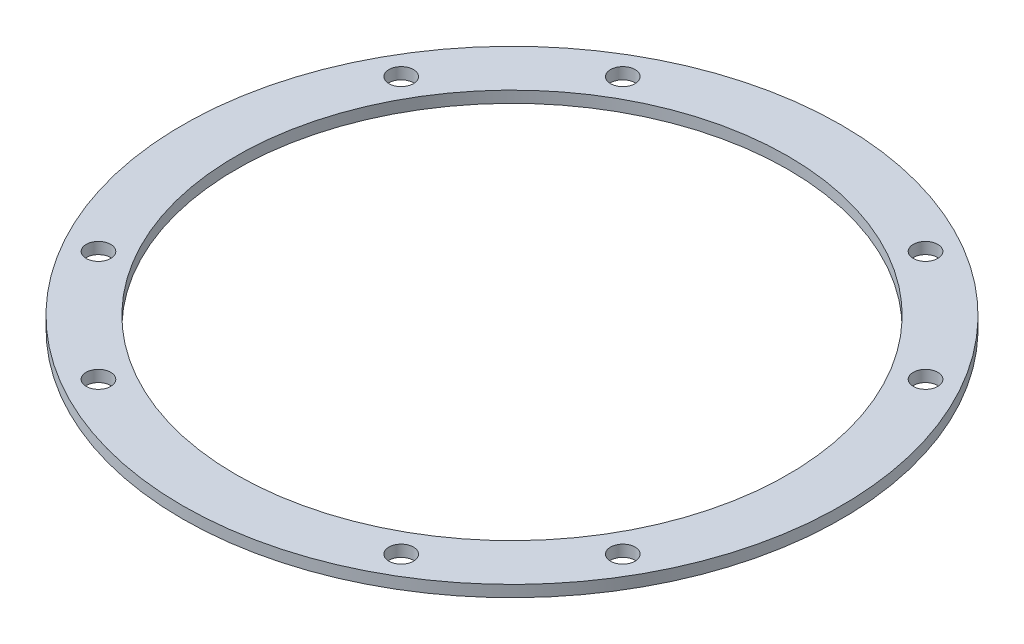
ISO-10303-21;
HEADER;
FILE_DESCRIPTION(('STEP AP214'),'2;1');
FILE_NAME('part.step','',(''),(''),'','','');
FILE_SCHEMA(('AUTOMOTIVE_DESIGN { 1 0 10303 214 1 1 1 1 }'));
ENDSEC;
DATA;
#1=APPLICATION_CONTEXT('core data for automotive mechanical design processes');
#2=APPLICATION_PROTOCOL_DEFINITION('international standard','automotive_design',2000,#1);
#3=PRODUCT_CONTEXT('',#1,'mechanical');
#4=PRODUCT('Part','Part','',(#3));
#5=PRODUCT_RELATED_PRODUCT_CATEGORY('part','',(#4));
#6=PRODUCT_DEFINITION_FORMATION('','',#4);
#7=PRODUCT_DEFINITION_CONTEXT('part definition',#1,'design');
#8=PRODUCT_DEFINITION('design','',#6,#7);
#9=PRODUCT_DEFINITION_SHAPE('','',#8);
#10=(LENGTH_UNIT() NAMED_UNIT(*) SI_UNIT(.MILLI.,.METRE.));
#11=(NAMED_UNIT(*) PLANE_ANGLE_UNIT() SI_UNIT($,.RADIAN.));
#12=(NAMED_UNIT(*) SI_UNIT($,.STERADIAN.) SOLID_ANGLE_UNIT());
#13=UNCERTAINTY_MEASURE_WITH_UNIT(LENGTH_MEASURE(1.E-05),#10,'distance_accuracy_value','');
#14=(GEOMETRIC_REPRESENTATION_CONTEXT(3) GLOBAL_UNCERTAINTY_ASSIGNED_CONTEXT((#13)) GLOBAL_UNIT_ASSIGNED_CONTEXT((#10,
#11,#12)) REPRESENTATION_CONTEXT('',''));
#15=CARTESIAN_POINT('',(0.,0.,0.));
#16=DIRECTION('',(0.,0.,1.));
#17=DIRECTION('',(1.,0.,0.));
#18=AXIS2_PLACEMENT_3D('',#15,#16,#17);
#19=CARTESIAN_POINT('',(0.,0.75,0.));
#20=DIRECTION('',(0.,1.,0.));
#21=DIRECTION('',(0.,0.,1.));
#22=AXIS2_PLACEMENT_3D('',#19,#20,#21);
#23=PLANE('',#22);
#24=CARTESIAN_POINT('',(-34.2080034494853,0.750000000000001,19.7500000000001));
#25=DIRECTION('',(0.,1.,0.));
#26=DIRECTION('',(0.,0.,1.));
#27=AXIS2_PLACEMENT_3D('',#24,#25,#26);
#28=CIRCLE('',#27,1.59999999999999);
#29=CARTESIAN_POINT('',(-34.2080034494853,0.750000000000001,21.35));
#30=VERTEX_POINT('',#29);
#31=EDGE_CURVE('E102',#30,#30,#28,.T.);
#32=ORIENTED_EDGE('',*,*,#31,.F.);
#33=EDGE_LOOP('',(#32));
#34=FACE_BOUND('',#33,.T.);
#35=CARTESIAN_POINT('',(-34.2080034494853,0.750000000000001,-19.75));
#36=DIRECTION('',(0.,1.,0.));
#37=DIRECTION('',(0.,0.,1.));
#38=AXIS2_PLACEMENT_3D('',#35,#36,#37);
#39=CIRCLE('',#38,1.59999999999999);
#40=CARTESIAN_POINT('',(-34.2080034494853,0.750000000000001,-18.15));
#41=VERTEX_POINT('',#40);
#42=EDGE_CURVE('E96',#41,#41,#39,.T.);
#43=ORIENTED_EDGE('',*,*,#42,.F.);
#44=EDGE_LOOP('',(#43));
#45=FACE_BOUND('',#44,.T.);
#46=CARTESIAN_POINT('',(-19.7500000000005,0.750000000000001,-34.2080034494868));
#47=DIRECTION('',(0.,1.,0.));
#48=DIRECTION('',(0.,0.,1.));
#49=AXIS2_PLACEMENT_3D('',#46,#47,#48);
#50=CIRCLE('',#49,1.59999999999999);
#51=CARTESIAN_POINT('',(-19.7500000000005,0.750000000000001,-32.6080034494868));
#52=VERTEX_POINT('',#51);
#53=EDGE_CURVE('E90',#52,#52,#50,.T.);
#54=ORIENTED_EDGE('',*,*,#53,.F.);
#55=EDGE_LOOP('',(#54));
#56=FACE_BOUND('',#55,.T.);
#57=CARTESIAN_POINT('',(19.7499999999996,0.750000000000001,-34.2080034494868));
#58=DIRECTION('',(0.,1.,0.));
#59=DIRECTION('',(0.,0.,1.));
#60=AXIS2_PLACEMENT_3D('',#57,#58,#59);
#61=CIRCLE('',#60,1.59999999999999);
#62=CARTESIAN_POINT('',(19.7499999999996,0.750000000000001,-32.6080034494868));
#63=VERTEX_POINT('',#62);
#64=EDGE_CURVE('E84',#63,#63,#61,.T.);
#65=ORIENTED_EDGE('',*,*,#64,.F.);
#66=EDGE_LOOP('',(#65));
#67=FACE_BOUND('',#66,.T.);
#68=CARTESIAN_POINT('',(34.2080034494864,0.750000000000001,-19.750000000002));
#69=DIRECTION('',(0.,1.,0.));
#70=DIRECTION('',(0.,0.,1.));
#71=AXIS2_PLACEMENT_3D('',#68,#69,#70);
#72=CIRCLE('',#71,1.59999999999999);
#73=CARTESIAN_POINT('',(34.2080034494864,0.750000000000001,-18.150000000002));
#74=VERTEX_POINT('',#73);
#75=EDGE_CURVE('E78',#74,#74,#72,.T.);
#76=ORIENTED_EDGE('',*,*,#75,.F.);
#77=EDGE_LOOP('',(#76));
#78=FACE_BOUND('',#77,.T.);
#79=CARTESIAN_POINT('',(34.2080034494864,0.750000000000001,19.7499999999981));
#80=DIRECTION('',(0.,1.,0.));
#81=DIRECTION('',(0.,0.,1.));
#82=AXIS2_PLACEMENT_3D('',#79,#80,#81);
#83=CIRCLE('',#82,1.59999999999998);
#84=CARTESIAN_POINT('',(34.2080034494864,0.750000000000001,21.3499999999981));
#85=VERTEX_POINT('',#84);
#86=EDGE_CURVE('E72',#85,#85,#83,.T.);
#87=ORIENTED_EDGE('',*,*,#86,.F.);
#88=EDGE_LOOP('',(#87));
#89=FACE_BOUND('',#88,.T.);
#90=CARTESIAN_POINT('',(19.7500000000016,0.750000000000001,34.2080034494849));
#91=DIRECTION('',(0.,1.,0.));
#92=DIRECTION('',(0.,0.,1.));
#93=AXIS2_PLACEMENT_3D('',#90,#91,#92);
#94=CIRCLE('',#93,1.59999999999999);
#95=CARTESIAN_POINT('',(19.7500000000016,0.750000000000001,35.8080034494849));
#96=VERTEX_POINT('',#95);
#97=EDGE_CURVE('E66',#96,#96,#94,.T.);
#98=ORIENTED_EDGE('',*,*,#97,.F.);
#99=EDGE_LOOP('',(#98));
#100=FACE_BOUND('',#99,.T.);
#101=CARTESIAN_POINT('',(-19.7499999999985,0.750000000000001,34.2080034494849));
#102=DIRECTION('',(0.,1.,0.));
#103=DIRECTION('',(0.,0.,1.));
#104=AXIS2_PLACEMENT_3D('',#101,#102,#103);
#105=CIRCLE('',#104,1.59999999999999);
#106=CARTESIAN_POINT('',(-19.7499999999985,0.750000000000001,35.8080034494849));
#107=VERTEX_POINT('',#106);
#108=EDGE_CURVE('E60',#107,#107,#105,.T.);
#109=ORIENTED_EDGE('',*,*,#108,.F.);
#110=EDGE_LOOP('',(#109));
#111=FACE_BOUND('',#110,.T.);
#112=CARTESIAN_POINT('',(0.,0.75,0.));
#113=DIRECTION('',(0.,1.,0.));
#114=DIRECTION('',(0.,0.,1.));
#115=AXIS2_PLACEMENT_3D('',#112,#113,#114);
#116=CIRCLE('',#115,43.);
#117=CARTESIAN_POINT('',(0.,0.75,43.));
#118=VERTEX_POINT('',#117);
#119=EDGE_CURVE('E10',#118,#118,#116,.T.);
#120=ORIENTED_EDGE('',*,*,#119,.T.);
#121=EDGE_LOOP('',(#120));
#122=FACE_BOUND('',#121,.T.);
#123=CARTESIAN_POINT('',(0.,0.75,0.));
#124=DIRECTION('',(0.,1.,0.));
#125=DIRECTION('',(0.,0.,1.));
#126=AXIS2_PLACEMENT_3D('',#123,#124,#125);
#127=CIRCLE('',#126,36.);
#128=CARTESIAN_POINT('',(0.,0.75,36.));
#129=VERTEX_POINT('',#128);
#130=EDGE_CURVE('E50',#129,#129,#127,.T.);
#131=ORIENTED_EDGE('',*,*,#130,.F.);
#132=EDGE_LOOP('',(#131));
#133=FACE_BOUND('',#132,.T.);
#134=ADVANCED_FACE('F39',(#34,#45,#56,#67,#78,#89,#100,#111,#122,#133),#23,.T.);
#135=CARTESIAN_POINT('',(0.,-0.75,0.));
#136=DIRECTION('',(0.,1.,0.));
#137=DIRECTION('',(0.,0.,1.));
#138=AXIS2_PLACEMENT_3D('',#135,#136,#137);
#139=PLANE('',#138);
#140=CARTESIAN_POINT('',(-34.2080034494853,-0.75,19.7500000000001));
#141=DIRECTION('',(0.,1.,0.));
#142=DIRECTION('',(0.,0.,1.));
#143=AXIS2_PLACEMENT_3D('',#140,#141,#142);
#144=CIRCLE('',#143,1.6);
#145=CARTESIAN_POINT('',(-34.2080034494853,-0.75,21.3500000000001));
#146=VERTEX_POINT('',#145);
#147=EDGE_CURVE('E99',#146,#146,#144,.T.);
#148=ORIENTED_EDGE('',*,*,#147,.T.);
#149=EDGE_LOOP('',(#148));
#150=FACE_BOUND('',#149,.T.);
#151=CARTESIAN_POINT('',(-34.2080034494853,-0.75,-19.75));
#152=DIRECTION('',(0.,1.,0.));
#153=DIRECTION('',(0.,0.,1.));
#154=AXIS2_PLACEMENT_3D('',#151,#152,#153);
#155=CIRCLE('',#154,1.6);
#156=CARTESIAN_POINT('',(-34.2080034494853,-0.75,-18.15));
#157=VERTEX_POINT('',#156);
#158=EDGE_CURVE('E93',#157,#157,#155,.T.);
#159=ORIENTED_EDGE('',*,*,#158,.T.);
#160=EDGE_LOOP('',(#159));
#161=FACE_BOUND('',#160,.T.);
#162=CARTESIAN_POINT('',(-19.7500000000005,-0.75,-34.2080034494868));
#163=DIRECTION('',(0.,1.,0.));
#164=DIRECTION('',(0.,0.,1.));
#165=AXIS2_PLACEMENT_3D('',#162,#163,#164);
#166=CIRCLE('',#165,1.6);
#167=CARTESIAN_POINT('',(-19.7500000000005,-0.75,-32.6080034494868));
#168=VERTEX_POINT('',#167);
#169=EDGE_CURVE('E87',#168,#168,#166,.T.);
#170=ORIENTED_EDGE('',*,*,#169,.T.);
#171=EDGE_LOOP('',(#170));
#172=FACE_BOUND('',#171,.T.);
#173=CARTESIAN_POINT('',(19.7499999999996,-0.75,-34.2080034494868));
#174=DIRECTION('',(0.,1.,0.));
#175=DIRECTION('',(0.,0.,1.));
#176=AXIS2_PLACEMENT_3D('',#173,#174,#175);
#177=CIRCLE('',#176,1.6);
#178=CARTESIAN_POINT('',(19.7499999999996,-0.75,-32.6080034494868));
#179=VERTEX_POINT('',#178);
#180=EDGE_CURVE('E81',#179,#179,#177,.T.);
#181=ORIENTED_EDGE('',*,*,#180,.T.);
#182=EDGE_LOOP('',(#181));
#183=FACE_BOUND('',#182,.T.);
#184=CARTESIAN_POINT('',(34.2080034494864,-0.75,-19.750000000002));
#185=DIRECTION('',(0.,1.,0.));
#186=DIRECTION('',(0.,0.,1.));
#187=AXIS2_PLACEMENT_3D('',#184,#185,#186);
#188=CIRCLE('',#187,1.6);
#189=CARTESIAN_POINT('',(34.2080034494864,-0.75,-18.150000000002));
#190=VERTEX_POINT('',#189);
#191=EDGE_CURVE('E75',#190,#190,#188,.T.);
#192=ORIENTED_EDGE('',*,*,#191,.T.);
#193=EDGE_LOOP('',(#192));
#194=FACE_BOUND('',#193,.T.);
#195=CARTESIAN_POINT('',(34.2080034494864,-0.75,19.7499999999981));
#196=DIRECTION('',(0.,1.,0.));
#197=DIRECTION('',(0.,0.,1.));
#198=AXIS2_PLACEMENT_3D('',#195,#196,#197);
#199=CIRCLE('',#198,1.6);
#200=CARTESIAN_POINT('',(34.2080034494864,-0.75,21.3499999999981));
#201=VERTEX_POINT('',#200);
#202=EDGE_CURVE('E69',#201,#201,#199,.T.);
#203=ORIENTED_EDGE('',*,*,#202,.T.);
#204=EDGE_LOOP('',(#203));
#205=FACE_BOUND('',#204,.T.);
#206=CARTESIAN_POINT('',(19.7500000000016,-0.75,34.2080034494849));
#207=DIRECTION('',(0.,1.,0.));
#208=DIRECTION('',(0.,0.,1.));
#209=AXIS2_PLACEMENT_3D('',#206,#207,#208);
#210=CIRCLE('',#209,1.6);
#211=CARTESIAN_POINT('',(19.7500000000016,-0.75,35.8080034494849));
#212=VERTEX_POINT('',#211);
#213=EDGE_CURVE('E63',#212,#212,#210,.T.);
#214=ORIENTED_EDGE('',*,*,#213,.T.);
#215=EDGE_LOOP('',(#214));
#216=FACE_BOUND('',#215,.T.);
#217=CARTESIAN_POINT('',(-19.7499999999985,-0.75,34.2080034494849));
#218=DIRECTION('',(0.,1.,0.));
#219=DIRECTION('',(0.,0.,1.));
#220=AXIS2_PLACEMENT_3D('',#217,#218,#219);
#221=CIRCLE('',#220,1.6);
#222=CARTESIAN_POINT('',(-19.7499999999985,-0.75,35.8080034494849));
#223=VERTEX_POINT('',#222);
#224=EDGE_CURVE('E55',#223,#223,#221,.T.);
#225=ORIENTED_EDGE('',*,*,#224,.T.);
#226=EDGE_LOOP('',(#225));
#227=FACE_BOUND('',#226,.T.);
#228=CARTESIAN_POINT('',(0.,-0.75,0.));
#229=DIRECTION('',(0.,1.,0.));
#230=DIRECTION('',(0.,0.,1.));
#231=AXIS2_PLACEMENT_3D('',#228,#229,#230);
#232=CIRCLE('',#231,43.);
#233=CARTESIAN_POINT('',(0.,-0.75,43.));
#234=VERTEX_POINT('',#233);
#235=EDGE_CURVE('E43',#234,#234,#232,.T.);
#236=ORIENTED_EDGE('',*,*,#235,.F.);
#237=EDGE_LOOP('',(#236));
#238=FACE_BOUND('',#237,.T.);
#239=CARTESIAN_POINT('',(0.,-0.75,0.));
#240=DIRECTION('',(0.,1.,0.));
#241=DIRECTION('',(0.,0.,1.));
#242=AXIS2_PLACEMENT_3D('',#239,#240,#241);
#243=CIRCLE('',#242,36.);
#244=CARTESIAN_POINT('',(0.,-0.75,36.));
#245=VERTEX_POINT('',#244);
#246=EDGE_CURVE('E52',#245,#245,#243,.T.);
#247=ORIENTED_EDGE('',*,*,#246,.T.);
#248=EDGE_LOOP('',(#247));
#249=FACE_BOUND('',#248,.T.);
#250=ADVANCED_FACE('F110',(#150,#161,#172,#183,#194,#205,#216,#227,#238,#249),#139,.F.);
#251=CARTESIAN_POINT('',(0.,0.75,0.));
#252=DIRECTION('',(0.,-1.,0.));
#253=DIRECTION('',(0.,0.,-1.));
#254=AXIS2_PLACEMENT_3D('',#251,#252,#253);
#255=CYLINDRICAL_SURFACE('',#254,43.);
#256=ORIENTED_EDGE('',*,*,#119,.F.);
#257=EDGE_LOOP('',(#256));
#258=FACE_BOUND('',#257,.T.);
#259=ORIENTED_EDGE('',*,*,#235,.T.);
#260=EDGE_LOOP('',(#259));
#261=FACE_BOUND('',#260,.T.);
#262=ADVANCED_FACE('F41',(#258,#261),#255,.T.);
#263=CARTESIAN_POINT('',(0.,0.75,0.));
#264=DIRECTION('',(0.,-1.,0.));
#265=DIRECTION('',(0.,0.,-1.));
#266=AXIS2_PLACEMENT_3D('',#263,#264,#265);
#267=CYLINDRICAL_SURFACE('',#266,36.);
#268=ORIENTED_EDGE('',*,*,#130,.T.);
#269=EDGE_LOOP('',(#268));
#270=FACE_BOUND('',#269,.T.);
#271=ORIENTED_EDGE('',*,*,#246,.F.);
#272=EDGE_LOOP('',(#271));
#273=FACE_BOUND('',#272,.T.);
#274=ADVANCED_FACE('F128',(#270,#273),#267,.F.);
#275=CARTESIAN_POINT('',(-19.7499999999985,0.75,34.2080034494849));
#276=DIRECTION('',(0.,1.,0.));
#277=DIRECTION('',(0.,0.,1.));
#278=AXIS2_PLACEMENT_3D('',#275,#276,#277);
#279=CYLINDRICAL_SURFACE('',#278,1.59999999999999);
#280=ORIENTED_EDGE('',*,*,#224,.F.);
#281=EDGE_LOOP('',(#280));
#282=FACE_BOUND('',#281,.T.);
#283=ORIENTED_EDGE('',*,*,#108,.T.);
#284=EDGE_LOOP('',(#283));
#285=FACE_BOUND('',#284,.T.);
#286=ADVANCED_FACE('F131',(#282,#285),#279,.F.);
#287=CARTESIAN_POINT('',(19.7500000000016,0.75,34.2080034494849));
#288=DIRECTION('',(0.,1.,0.));
#289=DIRECTION('',(0.,0.,1.));
#290=AXIS2_PLACEMENT_3D('',#287,#288,#289);
#291=CYLINDRICAL_SURFACE('',#290,1.59999999999999);
#292=ORIENTED_EDGE('',*,*,#213,.F.);
#293=EDGE_LOOP('',(#292));
#294=FACE_BOUND('',#293,.T.);
#295=ORIENTED_EDGE('',*,*,#97,.T.);
#296=EDGE_LOOP('',(#295));
#297=FACE_BOUND('',#296,.T.);
#298=ADVANCED_FACE('F145',(#294,#297),#291,.F.);
#299=CARTESIAN_POINT('',(34.2080034494864,0.75,19.7499999999981));
#300=DIRECTION('',(0.,1.,0.));
#301=DIRECTION('',(0.,0.,1.));
#302=AXIS2_PLACEMENT_3D('',#299,#300,#301);
#303=CYLINDRICAL_SURFACE('',#302,1.59999999999999);
#304=ORIENTED_EDGE('',*,*,#202,.F.);
#305=EDGE_LOOP('',(#304));
#306=FACE_BOUND('',#305,.T.);
#307=ORIENTED_EDGE('',*,*,#86,.T.);
#308=EDGE_LOOP('',(#307));
#309=FACE_BOUND('',#308,.T.);
#310=ADVANCED_FACE('F149',(#306,#309),#303,.F.);
#311=CARTESIAN_POINT('',(34.2080034494864,0.75,-19.750000000002));
#312=DIRECTION('',(0.,1.,0.));
#313=DIRECTION('',(0.,0.,1.));
#314=AXIS2_PLACEMENT_3D('',#311,#312,#313);
#315=CYLINDRICAL_SURFACE('',#314,1.59999999999999);
#316=ORIENTED_EDGE('',*,*,#191,.F.);
#317=EDGE_LOOP('',(#316));
#318=FACE_BOUND('',#317,.T.);
#319=ORIENTED_EDGE('',*,*,#75,.T.);
#320=EDGE_LOOP('',(#319));
#321=FACE_BOUND('',#320,.T.);
#322=ADVANCED_FACE('F153',(#318,#321),#315,.F.);
#323=CARTESIAN_POINT('',(19.7499999999996,0.75,-34.2080034494868));
#324=DIRECTION('',(0.,1.,0.));
#325=DIRECTION('',(0.,0.,1.));
#326=AXIS2_PLACEMENT_3D('',#323,#324,#325);
#327=CYLINDRICAL_SURFACE('',#326,1.59999999999999);
#328=ORIENTED_EDGE('',*,*,#180,.F.);
#329=EDGE_LOOP('',(#328));
#330=FACE_BOUND('',#329,.T.);
#331=ORIENTED_EDGE('',*,*,#64,.T.);
#332=EDGE_LOOP('',(#331));
#333=FACE_BOUND('',#332,.T.);
#334=ADVANCED_FACE('F157',(#330,#333),#327,.F.);
#335=CARTESIAN_POINT('',(-19.7500000000005,0.75,-34.2080034494868));
#336=DIRECTION('',(0.,1.,0.));
#337=DIRECTION('',(0.,0.,1.));
#338=AXIS2_PLACEMENT_3D('',#335,#336,#337);
#339=CYLINDRICAL_SURFACE('',#338,1.59999999999999);
#340=ORIENTED_EDGE('',*,*,#169,.F.);
#341=EDGE_LOOP('',(#340));
#342=FACE_BOUND('',#341,.T.);
#343=ORIENTED_EDGE('',*,*,#53,.T.);
#344=EDGE_LOOP('',(#343));
#345=FACE_BOUND('',#344,.T.);
#346=ADVANCED_FACE('F161',(#342,#345),#339,.F.);
#347=CARTESIAN_POINT('',(-34.2080034494853,0.75,-19.75));
#348=DIRECTION('',(0.,1.,0.));
#349=DIRECTION('',(0.,0.,1.));
#350=AXIS2_PLACEMENT_3D('',#347,#348,#349);
#351=CYLINDRICAL_SURFACE('',#350,1.59999999999999);
#352=ORIENTED_EDGE('',*,*,#158,.F.);
#353=EDGE_LOOP('',(#352));
#354=FACE_BOUND('',#353,.T.);
#355=ORIENTED_EDGE('',*,*,#42,.T.);
#356=EDGE_LOOP('',(#355));
#357=FACE_BOUND('',#356,.T.);
#358=ADVANCED_FACE('F165',(#354,#357),#351,.F.);
#359=CARTESIAN_POINT('',(-34.2080034494853,0.75,19.7500000000001));
#360=DIRECTION('',(0.,1.,0.));
#361=DIRECTION('',(0.,0.,1.));
#362=AXIS2_PLACEMENT_3D('',#359,#360,#361);
#363=CYLINDRICAL_SURFACE('',#362,1.59999999999999);
#364=ORIENTED_EDGE('',*,*,#147,.F.);
#365=EDGE_LOOP('',(#364));
#366=FACE_BOUND('',#365,.T.);
#367=ORIENTED_EDGE('',*,*,#31,.T.);
#368=EDGE_LOOP('',(#367));
#369=FACE_BOUND('',#368,.T.);
#370=ADVANCED_FACE('F106',(#366,#369),#363,.F.);
#371=CLOSED_SHELL('',(#134,#250,#262,#274,#286,#298,#310,#322,#334,#346,#358,#370));
#372=MANIFOLD_SOLID_BREP('B2',#371);
#373=ADVANCED_BREP_SHAPE_REPRESENTATION('',(#18,#372),#14);
#374=SHAPE_DEFINITION_REPRESENTATION(#9,#373);
ENDSEC;
END-ISO-10303-21;
